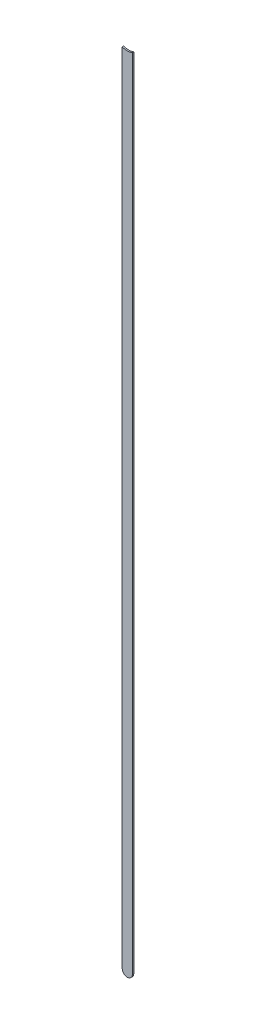
ISO-10303-21;
HEADER;
FILE_DESCRIPTION(('STEP AP214'),'2;1');
FILE_NAME('part.step','',(''),(''),'','','');
FILE_SCHEMA(('AUTOMOTIVE_DESIGN { 1 0 10303 214 1 1 1 1 }'));
ENDSEC;
DATA;
#1=APPLICATION_CONTEXT('core data for automotive mechanical design processes');
#2=APPLICATION_PROTOCOL_DEFINITION('international standard','automotive_design',2000,#1);
#3=PRODUCT_CONTEXT('',#1,'mechanical');
#4=PRODUCT('Part','Part','',(#3));
#5=PRODUCT_RELATED_PRODUCT_CATEGORY('part','',(#4));
#6=PRODUCT_DEFINITION_FORMATION('','',#4);
#7=PRODUCT_DEFINITION_CONTEXT('part definition',#1,'design');
#8=PRODUCT_DEFINITION('design','',#6,#7);
#9=PRODUCT_DEFINITION_SHAPE('','',#8);
#10=(LENGTH_UNIT() NAMED_UNIT(*) SI_UNIT(.MILLI.,.METRE.));
#11=(NAMED_UNIT(*) PLANE_ANGLE_UNIT() SI_UNIT($,.RADIAN.));
#12=(NAMED_UNIT(*) SI_UNIT($,.STERADIAN.) SOLID_ANGLE_UNIT());
#13=UNCERTAINTY_MEASURE_WITH_UNIT(LENGTH_MEASURE(1.E-05),#10,'distance_accuracy_value','');
#14=(GEOMETRIC_REPRESENTATION_CONTEXT(3) GLOBAL_UNCERTAINTY_ASSIGNED_CONTEXT((#13)) GLOBAL_UNIT_ASSIGNED_CONTEXT((#10,
#11,#12)) REPRESENTATION_CONTEXT('',''));
#15=CARTESIAN_POINT('',(0.,0.,0.));
#16=DIRECTION('',(0.,0.,1.));
#17=DIRECTION('',(1.,0.,0.));
#18=AXIS2_PLACEMENT_3D('',#15,#16,#17);
#19=CARTESIAN_POINT('',(79.6439733,54.28697042,0.));
#20=DIRECTION('',(-1.,0.,0.));
#21=DIRECTION('',(0.,1.,0.));
#22=AXIS2_PLACEMENT_3D('',#19,#20,#21);
#23=PLANE('',#22);
#24=DIRECTION('',(0.,1.,0.));
#25=VECTOR('',#24,1.);
#26=CARTESIAN_POINT('',(79.6439733,54.28697042,0.03556));
#27=LINE('',#26,#25);
#28=CARTESIAN_POINT('',(79.6439733,54.28697042,0.03556));
#29=VERTEX_POINT('',#28);
#30=CARTESIAN_POINT('',(79.6439733,74.2548249005022,0.03556));
#31=VERTEX_POINT('',#30);
#32=EDGE_CURVE('E11',#29,#31,#27,.T.);
#33=ORIENTED_EDGE('',*,*,#32,.F.);
#34=DIRECTION('',(0.,0.,1.));
#35=VECTOR('',#34,1.);
#36=CARTESIAN_POINT('',(79.6439733,54.28697042,0.));
#37=LINE('',#36,#35);
#38=CARTESIAN_POINT('',(79.6439733,54.28697042,0.));
#39=VERTEX_POINT('',#38);
#40=EDGE_CURVE('E24',#39,#29,#37,.T.);
#41=ORIENTED_EDGE('',*,*,#40,.F.);
#42=DIRECTION('',(0.,1.,0.));
#43=VECTOR('',#42,1.);
#44=CARTESIAN_POINT('',(79.6439733,54.28697042,0.));
#45=LINE('',#44,#43);
#46=CARTESIAN_POINT('',(79.6439733,74.2548249005022,0.));
#47=VERTEX_POINT('',#46);
#48=EDGE_CURVE('E75',#39,#47,#45,.T.);
#49=ORIENTED_EDGE('',*,*,#48,.T.);
#50=DIRECTION('',(0.,0.,1.));
#51=VECTOR('',#50,1.);
#52=CARTESIAN_POINT('',(79.6439733,74.2548249005022,0.));
#53=LINE('',#52,#51);
#54=EDGE_CURVE('E37',#47,#31,#53,.T.);
#55=ORIENTED_EDGE('',*,*,#54,.T.);
#56=EDGE_LOOP('',(#33,#41,#49,#55));
#57=FACE_BOUND('',#56,.T.);
#58=ADVANCED_FACE('F17',(#57),#23,.F.);
#59=CARTESIAN_POINT('',(79.5169733,74.586973,0.));
#60=DIRECTION('',(0.,0.,-1.));
#61=DIRECTION('',(1.,0.,0.));
#62=AXIS2_PLACEMENT_3D('',#59,#60,#61);
#63=CYLINDRICAL_SURFACE('',#62,0.3556);
#64=DIRECTION('',(0.,0.,1.));
#65=VECTOR('',#64,1.);
#66=CARTESIAN_POINT('',(79.3899733,74.2548249005022,0.));
#67=LINE('',#66,#65);
#68=CARTESIAN_POINT('',(79.3899733,74.2548249005022,0.));
#69=VERTEX_POINT('',#68);
#70=CARTESIAN_POINT('',(79.3899733,74.2548249005022,0.03556));
#71=VERTEX_POINT('',#70);
#72=EDGE_CURVE('E67',#69,#71,#67,.T.);
#73=ORIENTED_EDGE('',*,*,#72,.T.);
#74=CARTESIAN_POINT('',(79.5169733,74.586973,0.03556));
#75=DIRECTION('',(0.,0.,1.));
#76=DIRECTION('',(1.,0.,0.));
#77=AXIS2_PLACEMENT_3D('',#74,#75,#76);
#78=CIRCLE('',#77,0.3556);
#79=EDGE_CURVE('E82',#71,#31,#78,.T.);
#80=ORIENTED_EDGE('',*,*,#79,.T.);
#81=ORIENTED_EDGE('',*,*,#54,.F.);
#82=CARTESIAN_POINT('',(79.5169733,74.586973,0.));
#83=DIRECTION('',(0.,0.,1.));
#84=DIRECTION('',(1.,0.,0.));
#85=AXIS2_PLACEMENT_3D('',#82,#83,#84);
#86=CIRCLE('',#85,0.3556);
#87=EDGE_CURVE('E80',#69,#47,#86,.T.);
#88=ORIENTED_EDGE('',*,*,#87,.F.);
#89=EDGE_LOOP('',(#73,#80,#81,#88));
#90=FACE_BOUND('',#89,.T.);
#91=ADVANCED_FACE('F88',(#90),#63,.F.);
#92=CARTESIAN_POINT('',(79.3899733,74.2548249005022,0.));
#93=DIRECTION('',(1.,0.,0.));
#94=DIRECTION('',(0.,-1.,0.));
#95=AXIS2_PLACEMENT_3D('',#92,#93,#94);
#96=PLANE('',#95);
#97=DIRECTION('',(0.,-1.,0.));
#98=VECTOR('',#97,1.);
#99=CARTESIAN_POINT('',(79.3899733,74.586973,0.03556));
#100=LINE('',#99,#98);
#101=CARTESIAN_POINT('',(79.3899733,54.28697042,0.03556));
#102=VERTEX_POINT('',#101);
#103=EDGE_CURVE('E71',#71,#102,#100,.T.);
#104=ORIENTED_EDGE('',*,*,#103,.F.);
#105=ORIENTED_EDGE('',*,*,#72,.F.);
#106=DIRECTION('',(0.,-1.,0.));
#107=VECTOR('',#106,1.);
#108=CARTESIAN_POINT('',(79.3899733,74.586973,0.));
#109=LINE('',#108,#107);
#110=CARTESIAN_POINT('',(79.3899733,54.28697042,0.));
#111=VERTEX_POINT('',#110);
#112=EDGE_CURVE('E63',#69,#111,#109,.T.);
#113=ORIENTED_EDGE('',*,*,#112,.T.);
#114=DIRECTION('',(0.,0.,1.));
#115=VECTOR('',#114,1.);
#116=CARTESIAN_POINT('',(79.3899733,54.28697042,0.));
#117=LINE('',#116,#115);
#118=EDGE_CURVE('E53',#111,#102,#117,.T.);
#119=ORIENTED_EDGE('',*,*,#118,.T.);
#120=EDGE_LOOP('',(#104,#105,#113,#119));
#121=FACE_BOUND('',#120,.T.);
#122=ADVANCED_FACE('F66',(#121),#96,.F.);
#123=CARTESIAN_POINT('',(79.5169733,54.28697042,0.));
#124=DIRECTION('',(0.,0.,-1.));
#125=DIRECTION('',(-1.,0.,0.));
#126=AXIS2_PLACEMENT_3D('',#123,#124,#125);
#127=CYLINDRICAL_SURFACE('',#126,0.127);
#128=CARTESIAN_POINT('',(79.5169733,54.28697042,0.03556));
#129=DIRECTION('',(0.,0.,1.));
#130=DIRECTION('',(-1.,0.,0.));
#131=AXIS2_PLACEMENT_3D('',#128,#129,#130);
#132=CIRCLE('',#131,0.127);
#133=EDGE_CURVE('E59',#102,#29,#132,.T.);
#134=ORIENTED_EDGE('',*,*,#133,.F.);
#135=ORIENTED_EDGE('',*,*,#118,.F.);
#136=CARTESIAN_POINT('',(79.5169733,54.28697042,0.));
#137=DIRECTION('',(0.,0.,1.));
#138=DIRECTION('',(-1.,0.,0.));
#139=AXIS2_PLACEMENT_3D('',#136,#137,#138);
#140=CIRCLE('',#139,0.127);
#141=EDGE_CURVE('E57',#111,#39,#140,.T.);
#142=ORIENTED_EDGE('',*,*,#141,.T.);
#143=ORIENTED_EDGE('',*,*,#40,.T.);
#144=EDGE_LOOP('',(#134,#135,#142,#143));
#145=FACE_BOUND('',#144,.T.);
#146=ADVANCED_FACE('F55',(#145),#127,.T.);
#147=CARTESIAN_POINT('',(79.6439733,54.28697042,0.));
#148=DIRECTION('',(0.,0.,-1.));
#149=DIRECTION('',(-1.,0.,0.));
#150=AXIS2_PLACEMENT_3D('',#147,#148,#149);
#151=PLANE('',#150);
#152=ORIENTED_EDGE('',*,*,#48,.F.);
#153=ORIENTED_EDGE('',*,*,#141,.F.);
#154=ORIENTED_EDGE('',*,*,#112,.F.);
#155=ORIENTED_EDGE('',*,*,#87,.T.);
#156=EDGE_LOOP('',(#152,#153,#154,#155));
#157=FACE_BOUND('',#156,.T.);
#158=ADVANCED_FACE('F74',(#157),#151,.T.);
#159=CARTESIAN_POINT('',(79.6439733,54.28697042,0.03556));
#160=DIRECTION('',(0.,0.,-1.));
#161=DIRECTION('',(-1.,0.,0.));
#162=AXIS2_PLACEMENT_3D('',#159,#160,#161);
#163=PLANE('',#162);
#164=ORIENTED_EDGE('',*,*,#133,.T.);
#165=ORIENTED_EDGE('',*,*,#32,.T.);
#166=ORIENTED_EDGE('',*,*,#79,.F.);
#167=ORIENTED_EDGE('',*,*,#103,.T.);
#168=EDGE_LOOP('',(#164,#165,#166,#167));
#169=FACE_BOUND('',#168,.T.);
#170=ADVANCED_FACE('F91',(#169),#163,.F.);
#171=CLOSED_SHELL('',(#58,#91,#122,#146,#158,#170));
#172=MANIFOLD_SOLID_BREP('B1',#171);
#173=ADVANCED_BREP_SHAPE_REPRESENTATION('',(#18,#172),#14);
#174=SHAPE_DEFINITION_REPRESENTATION(#9,#173);
ENDSEC;
END-ISO-10303-21;
